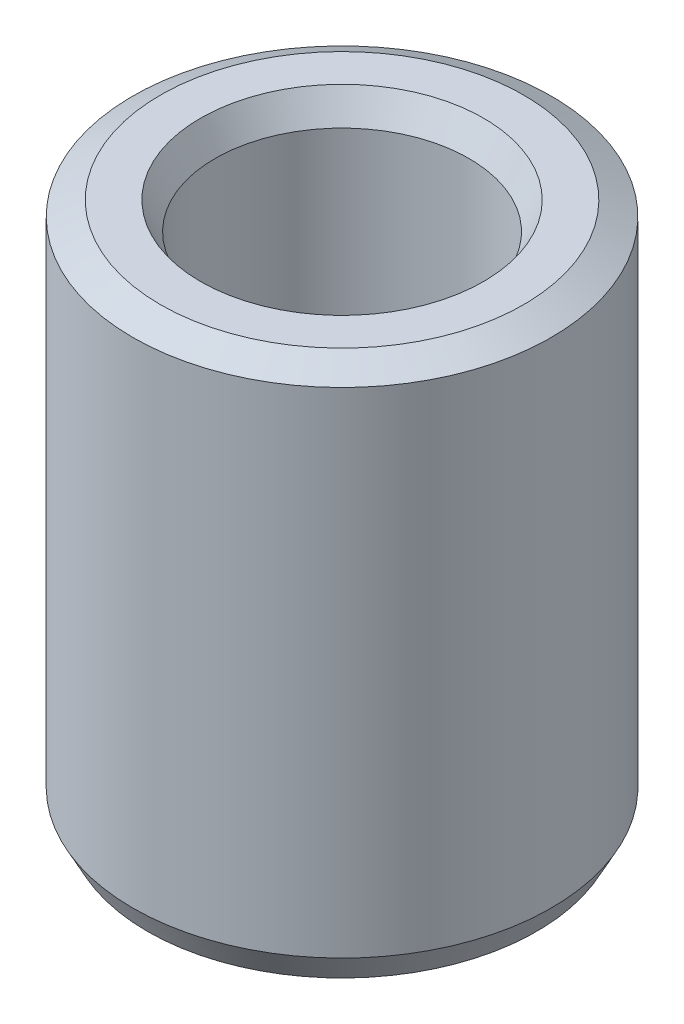
ISO-10303-21;
HEADER;
FILE_DESCRIPTION(('STEP AP214'),'2;1');
FILE_NAME('part.step','',(''),(''),'','','');
FILE_SCHEMA(('AUTOMOTIVE_DESIGN { 1 0 10303 214 1 1 1 1 }'));
ENDSEC;
DATA;
#1=APPLICATION_CONTEXT('core data for automotive mechanical design processes');
#2=APPLICATION_PROTOCOL_DEFINITION('international standard','automotive_design',2000,#1);
#3=PRODUCT_CONTEXT('',#1,'mechanical');
#4=PRODUCT('Part','Part','',(#3));
#5=PRODUCT_RELATED_PRODUCT_CATEGORY('part','',(#4));
#6=PRODUCT_DEFINITION_FORMATION('','',#4);
#7=PRODUCT_DEFINITION_CONTEXT('part definition',#1,'design');
#8=PRODUCT_DEFINITION('design','',#6,#7);
#9=PRODUCT_DEFINITION_SHAPE('','',#8);
#10=(LENGTH_UNIT() NAMED_UNIT(*) SI_UNIT(.MILLI.,.METRE.));
#11=(NAMED_UNIT(*) PLANE_ANGLE_UNIT() SI_UNIT($,.RADIAN.));
#12=(NAMED_UNIT(*) SI_UNIT($,.STERADIAN.) SOLID_ANGLE_UNIT());
#13=UNCERTAINTY_MEASURE_WITH_UNIT(LENGTH_MEASURE(1.E-05),#10,'distance_accuracy_value','');
#14=(GEOMETRIC_REPRESENTATION_CONTEXT(3) GLOBAL_UNCERTAINTY_ASSIGNED_CONTEXT((#13)) GLOBAL_UNIT_ASSIGNED_CONTEXT((#10,
#11,#12)) REPRESENTATION_CONTEXT('',''));
#15=CARTESIAN_POINT('',(0.,0.,0.));
#16=DIRECTION('',(0.,0.,1.));
#17=DIRECTION('',(1.,0.,0.));
#18=AXIS2_PLACEMENT_3D('',#15,#16,#17);
#19=CARTESIAN_POINT('',(0.,128.201635517796,0.));
#20=DIRECTION('',(0.,-1.,0.));
#21=DIRECTION('',(0.,0.,-1.));
#22=AXIS2_PLACEMENT_3D('',#19,#20,#21);
#23=CYLINDRICAL_SURFACE('',#22,50.);
#24=CARTESIAN_POINT('',(0.,6.59277498164526,0.));
#25=DIRECTION('',(0.,1.,0.));
#26=DIRECTION('',(0.,0.,1.));
#27=AXIS2_PLACEMENT_3D('',#24,#25,#26);
#28=CIRCLE('',#27,50.);
#29=CARTESIAN_POINT('',(0.,6.59277498164526,50.));
#30=VERTEX_POINT('',#29);
#31=EDGE_CURVE('E10',#30,#30,#28,.T.);
#32=ORIENTED_EDGE('',*,*,#31,.T.);
#33=EDGE_LOOP('',(#32));
#34=FACE_BOUND('',#33,.T.);
#35=CARTESIAN_POINT('',(0.,124.707819507098,0.));
#36=DIRECTION('',(0.,1.,0.));
#37=DIRECTION('',(0.,0.,1.));
#38=AXIS2_PLACEMENT_3D('',#35,#36,#37);
#39=CIRCLE('',#38,50.);
#40=CARTESIAN_POINT('',(0.,124.707819507098,50.));
#41=VERTEX_POINT('',#40);
#42=EDGE_CURVE('E50',#41,#41,#39,.F.);
#43=ORIENTED_EDGE('',*,*,#42,.T.);
#44=EDGE_LOOP('',(#43));
#45=FACE_BOUND('',#44,.T.);
#46=ADVANCED_FACE('F39',(#34,#45),#23,.T.);
#47=CARTESIAN_POINT('',(0.,128.201635517796,0.));
#48=DIRECTION('',(0.,1.,0.));
#49=DIRECTION('',(0.,0.,1.));
#50=AXIS2_PLACEMENT_3D('',#47,#48,#49);
#51=PLANE('',#50);
#52=CARTESIAN_POINT('',(0.,128.201635517796,0.));
#53=DIRECTION('',(0.,1.,0.));
#54=DIRECTION('',(0.,0.,1.));
#55=AXIS2_PLACEMENT_3D('',#52,#53,#54);
#56=CIRCLE('',#55,33.8336820518194);
#57=CARTESIAN_POINT('',(0.,128.201635517796,33.8336820518194));
#58=VERTEX_POINT('',#57);
#59=EDGE_CURVE('E58',#58,#58,#56,.F.);
#60=ORIENTED_EDGE('',*,*,#59,.T.);
#61=EDGE_LOOP('',(#60));
#62=FACE_BOUND('',#61,.T.);
#63=CARTESIAN_POINT('',(0.,128.201635517796,0.));
#64=DIRECTION('',(0.,1.,0.));
#65=DIRECTION('',(0.,0.,1.));
#66=AXIS2_PLACEMENT_3D('',#63,#64,#65);
#67=CIRCLE('',#66,43.4072250183549);
#68=CARTESIAN_POINT('',(0.,128.201635517796,43.4072250183549));
#69=VERTEX_POINT('',#68);
#70=EDGE_CURVE('E61',#69,#69,#67,.T.);
#71=ORIENTED_EDGE('',*,*,#70,.T.);
#72=EDGE_LOOP('',(#71));
#73=FACE_BOUND('',#72,.T.);
#74=ADVANCED_FACE('F88',(#62,#73),#51,.T.);
#75=CARTESIAN_POINT('',(0.,0.,0.));
#76=DIRECTION('',(0.,1.,0.));
#77=DIRECTION('',(0.,0.,1.));
#78=AXIS2_PLACEMENT_3D('',#75,#76,#77);
#79=PLANE('',#78);
#80=CARTESIAN_POINT('',(0.,0.,0.));
#81=DIRECTION('',(0.,1.,0.));
#82=DIRECTION('',(0.,0.,1.));
#83=AXIS2_PLACEMENT_3D('',#80,#81,#82);
#84=CIRCLE('',#83,36.9326410227671);
#85=CARTESIAN_POINT('',(0.,0.,36.9326410227671));
#86=VERTEX_POINT('',#85);
#87=EDGE_CURVE('E51',#86,#86,#84,.T.);
#88=ORIENTED_EDGE('',*,*,#87,.T.);
#89=EDGE_LOOP('',(#88));
#90=FACE_BOUND('',#89,.T.);
#91=CARTESIAN_POINT('',(0.,0.,0.));
#92=DIRECTION('',(0.,1.,0.));
#93=DIRECTION('',(0.,0.,1.));
#94=AXIS2_PLACEMENT_3D('',#91,#92,#93);
#95=CIRCLE('',#94,46.5061839893024);
#96=CARTESIAN_POINT('',(0.,0.,46.5061839893024));
#97=VERTEX_POINT('',#96);
#98=EDGE_CURVE('E54',#97,#97,#95,.F.);
#99=ORIENTED_EDGE('',*,*,#98,.T.);
#100=EDGE_LOOP('',(#99));
#101=FACE_BOUND('',#100,.T.);
#102=ADVANCED_FACE('F83',(#90,#101),#79,.F.);
#103=CARTESIAN_POINT('',(0.,128.201635517796,0.));
#104=DIRECTION('',(0.,-1.,0.));
#105=DIRECTION('',(0.,0.,-1.));
#106=AXIS2_PLACEMENT_3D('',#103,#104,#105);
#107=CYLINDRICAL_SURFACE('',#106,30.3398660411219);
#108=CARTESIAN_POINT('',(0.,121.608860536151,0.));
#109=DIRECTION('',(0.,1.,0.));
#110=DIRECTION('',(0.,0.,1.));
#111=AXIS2_PLACEMENT_3D('',#108,#109,#110);
#112=CIRCLE('',#111,30.3398660411219);
#113=CARTESIAN_POINT('',(0.,121.608860536151,30.3398660411219));
#114=VERTEX_POINT('',#113);
#115=EDGE_CURVE('E67',#114,#114,#112,.T.);
#116=ORIENTED_EDGE('',*,*,#115,.T.);
#117=EDGE_LOOP('',(#116));
#118=FACE_BOUND('',#117,.T.);
#119=CARTESIAN_POINT('',(0.,3.49381601069751,0.));
#120=DIRECTION('',(0.,1.,0.));
#121=DIRECTION('',(0.,0.,1.));
#122=AXIS2_PLACEMENT_3D('',#119,#120,#121);
#123=CIRCLE('',#122,30.3398660411219);
#124=CARTESIAN_POINT('',(0.,3.49381601069751,30.3398660411219));
#125=VERTEX_POINT('',#124);
#126=EDGE_CURVE('E69',#125,#125,#123,.F.);
#127=ORIENTED_EDGE('',*,*,#126,.T.);
#128=EDGE_LOOP('',(#127));
#129=FACE_BOUND('',#128,.T.);
#130=ADVANCED_FACE('F71',(#118,#129),#107,.F.);
#131=CARTESIAN_POINT('',(0.,121.608860536151,0.));
#132=DIRECTION('',(0.,1.,0.));
#133=DIRECTION('',(0.,0.,1.));
#134=AXIS2_PLACEMENT_3D('',#131,#132,#133);
#135=CONICAL_SURFACE('',#134,30.3398660411219,0.487316572319373);
#136=ORIENTED_EDGE('',*,*,#59,.F.);
#137=EDGE_LOOP('',(#136));
#138=FACE_BOUND('',#137,.T.);
#139=ORIENTED_EDGE('',*,*,#115,.F.);
#140=EDGE_LOOP('',(#139));
#141=FACE_BOUND('',#140,.T.);
#142=ADVANCED_FACE('F77',(#138,#141),#135,.F.);
#143=CARTESIAN_POINT('',(0.,0.,0.));
#144=DIRECTION('',(0.,-1.,0.));
#145=DIRECTION('',(0.,0.,-1.));
#146=AXIS2_PLACEMENT_3D('',#143,#144,#145);
#147=CONICAL_SURFACE('',#146,36.9326410227671,1.08347975447552);
#148=ORIENTED_EDGE('',*,*,#126,.F.);
#149=EDGE_LOOP('',(#148));
#150=FACE_BOUND('',#149,.T.);
#151=ORIENTED_EDGE('',*,*,#87,.F.);
#152=EDGE_LOOP('',(#151));
#153=FACE_BOUND('',#152,.T.);
#154=ADVANCED_FACE('F73',(#150,#153),#147,.F.);
#155=CARTESIAN_POINT('',(0.,6.59277498164526,0.));
#156=DIRECTION('',(0.,1.,0.));
#157=DIRECTION('',(0.,0.,1.));
#158=AXIS2_PLACEMENT_3D('',#155,#156,#157);
#159=CONICAL_SURFACE('',#158,50.,0.487316572319375);
#160=ORIENTED_EDGE('',*,*,#98,.F.);
#161=EDGE_LOOP('',(#160));
#162=FACE_BOUND('',#161,.T.);
#163=ORIENTED_EDGE('',*,*,#31,.F.);
#164=EDGE_LOOP('',(#163));
#165=FACE_BOUND('',#164,.T.);
#166=ADVANCED_FACE('F76',(#162,#165),#159,.T.);
#167=CARTESIAN_POINT('',(0.,128.201635517796,0.));
#168=DIRECTION('',(0.,-1.,0.));
#169=DIRECTION('',(0.,0.,-1.));
#170=AXIS2_PLACEMENT_3D('',#167,#168,#169);
#171=CONICAL_SURFACE('',#170,43.4072250183549,1.08347975447552);
#172=ORIENTED_EDGE('',*,*,#42,.F.);
#173=EDGE_LOOP('',(#172));
#174=FACE_BOUND('',#173,.T.);
#175=ORIENTED_EDGE('',*,*,#70,.F.);
#176=EDGE_LOOP('',(#175));
#177=FACE_BOUND('',#176,.T.);
#178=ADVANCED_FACE('F45',(#174,#177),#171,.T.);
#179=CLOSED_SHELL('',(#46,#74,#102,#130,#142,#154,#166,#178));
#180=MANIFOLD_SOLID_BREP('B2',#179);
#181=ADVANCED_BREP_SHAPE_REPRESENTATION('',(#18,#180),#14);
#182=SHAPE_DEFINITION_REPRESENTATION(#9,#181);
ENDSEC;
END-ISO-10303-21;
